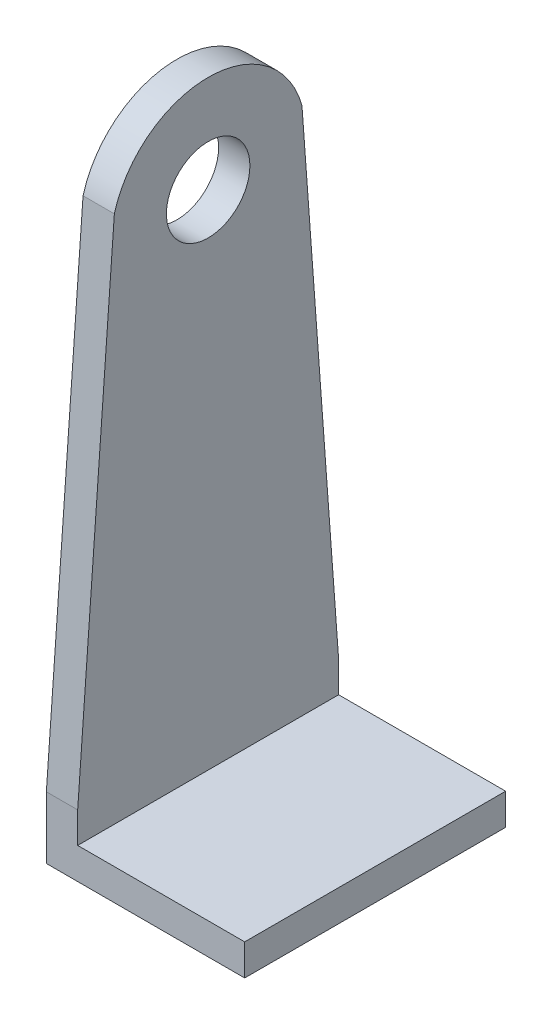
ISO-10303-21;
HEADER;
FILE_DESCRIPTION(('STEP AP214'),'2;1');
FILE_NAME('part.step','',(''),(''),'','','');
FILE_SCHEMA(('AUTOMOTIVE_DESIGN { 1 0 10303 214 1 1 1 1 }'));
ENDSEC;
DATA;
#1=APPLICATION_CONTEXT('core data for automotive mechanical design processes');
#2=APPLICATION_PROTOCOL_DEFINITION('international standard','automotive_design',2000,#1);
#3=PRODUCT_CONTEXT('',#1,'mechanical');
#4=PRODUCT('Part','Part','',(#3));
#5=PRODUCT_RELATED_PRODUCT_CATEGORY('part','',(#4));
#6=PRODUCT_DEFINITION_FORMATION('','',#4);
#7=PRODUCT_DEFINITION_CONTEXT('part definition',#1,'design');
#8=PRODUCT_DEFINITION('design','',#6,#7);
#9=PRODUCT_DEFINITION_SHAPE('','',#8);
#10=(LENGTH_UNIT() NAMED_UNIT(*) SI_UNIT(.MILLI.,.METRE.));
#11=(NAMED_UNIT(*) PLANE_ANGLE_UNIT() SI_UNIT($,.RADIAN.));
#12=(NAMED_UNIT(*) SI_UNIT($,.STERADIAN.) SOLID_ANGLE_UNIT());
#13=UNCERTAINTY_MEASURE_WITH_UNIT(LENGTH_MEASURE(1.E-05),#10,'distance_accuracy_value','');
#14=(GEOMETRIC_REPRESENTATION_CONTEXT(3) GLOBAL_UNCERTAINTY_ASSIGNED_CONTEXT((#13)) GLOBAL_UNIT_ASSIGNED_CONTEXT((#10,
#11,#12)) REPRESENTATION_CONTEXT('',''));
#15=CARTESIAN_POINT('',(0.,0.,0.));
#16=DIRECTION('',(0.,0.,1.));
#17=DIRECTION('',(1.,0.,0.));
#18=AXIS2_PLACEMENT_3D('',#15,#16,#17);
#19=CARTESIAN_POINT('',(15.5,-52.,0.));
#20=DIRECTION('',(-1.,0.,0.));
#21=DIRECTION('',(0.,0.,1.));
#22=AXIS2_PLACEMENT_3D('',#19,#20,#21);
#23=CYLINDRICAL_SURFACE('',#22,4.);
#24=CARTESIAN_POINT('',(16.5,-52.,0.));
#25=DIRECTION('',(-1.,0.,0.));
#26=DIRECTION('',(0.,0.,-1.));
#27=AXIS2_PLACEMENT_3D('',#24,#25,#26);
#28=CIRCLE('',#27,4.);
#29=CARTESIAN_POINT('',(16.5,-52.,-4.));
#30=VERTEX_POINT('',#29);
#31=EDGE_CURVE('E47',#30,#30,#28,.T.);
#32=ORIENTED_EDGE('',*,*,#31,.F.);
#33=EDGE_LOOP('',(#32));
#34=FACE_BOUND('',#33,.T.);
#35=CARTESIAN_POINT('',(13.5,-52.,0.));
#36=DIRECTION('',(1.,0.,0.));
#37=DIRECTION('',(0.,0.,-1.));
#38=AXIS2_PLACEMENT_3D('',#35,#36,#37);
#39=CIRCLE('',#38,4.);
#40=CARTESIAN_POINT('',(13.5,-52.,-4.));
#41=VERTEX_POINT('',#40);
#42=EDGE_CURVE('E166',#41,#41,#39,.T.);
#43=ORIENTED_EDGE('',*,*,#42,.F.);
#44=EDGE_LOOP('',(#43));
#45=FACE_BOUND('',#44,.T.);
#46=ADVANCED_FACE('F38',(#34,#45),#23,.F.);
#47=CARTESIAN_POINT('',(16.5,-100.7,-12.5));
#48=DIRECTION('',(1.,0.,0.));
#49=DIRECTION('',(0.,-1.,0.));
#50=AXIS2_PLACEMENT_3D('',#47,#48,#49);
#51=PLANE('',#50);
#52=DIRECTION('',(0.,-0.997297605701587,-0.0734675823876265));
#53=VECTOR('',#52,1.);
#54=CARTESIAN_POINT('',(16.5,-100.681108800183,-12.7564416540415));
#55=LINE('',#54,#53);
#56=CARTESIAN_POINT('',(16.5,-49.5,-8.986100377806));
#57=VERTEX_POINT('',#56);
#58=CARTESIAN_POINT('',(16.5,-97.2,-12.5));
#59=VERTEX_POINT('',#58);
#60=EDGE_CURVE('E117',#57,#59,#55,.T.);
#61=ORIENTED_EDGE('',*,*,#60,.F.);
#62=CARTESIAN_POINT('',(16.5,-52.0000000000001,0.));
#63=DIRECTION('',(1.,0.,0.));
#64=DIRECTION('',(0.,0.,-1.));
#65=AXIS2_PLACEMENT_3D('',#62,#63,#64);
#66=CIRCLE('',#65,9.32737905308911);
#67=CARTESIAN_POINT('',(16.5,-49.5,8.986100377806));
#68=VERTEX_POINT('',#67);
#69=EDGE_CURVE('E157',#57,#68,#66,.T.);
#70=ORIENTED_EDGE('',*,*,#69,.T.);
#71=DIRECTION('',(0.,0.997297605701587,-0.0734675823876265));
#72=VECTOR('',#71,1.);
#73=CARTESIAN_POINT('',(16.5,-98.8493826998868,12.6215045124945));
#74=LINE('',#73,#72);
#75=CARTESIAN_POINT('',(16.5,-97.2,12.5));
#76=VERTEX_POINT('',#75);
#77=EDGE_CURVE('E151',#76,#68,#74,.T.);
#78=ORIENTED_EDGE('',*,*,#77,.F.);
#79=DIRECTION('',(0.,1.,0.));
#80=VECTOR('',#79,1.);
#81=CARTESIAN_POINT('',(16.5,-100.7,12.5));
#82=LINE('',#81,#80);
#83=CARTESIAN_POINT('',(16.5,-100.149489742783,12.5));
#84=VERTEX_POINT('',#83);
#85=EDGE_CURVE('E122',#84,#76,#82,.T.);
#86=ORIENTED_EDGE('',*,*,#85,.F.);
#87=DIRECTION('',(0.,0.,1.));
#88=VECTOR('',#87,1.);
#89=CARTESIAN_POINT('',(16.5,-100.149489742783,12.5));
#90=LINE('',#89,#88);
#91=CARTESIAN_POINT('',(16.5,-100.149489742783,-12.5));
#92=VERTEX_POINT('',#91);
#93=EDGE_CURVE('E115',#92,#84,#90,.T.);
#94=ORIENTED_EDGE('',*,*,#93,.F.);
#95=DIRECTION('',(0.,1.,0.));
#96=VECTOR('',#95,1.);
#97=CARTESIAN_POINT('',(16.5,-100.7,-12.5));
#98=LINE('',#97,#96);
#99=EDGE_CURVE('E11',#92,#59,#98,.T.);
#100=ORIENTED_EDGE('',*,*,#99,.T.);
#101=EDGE_LOOP('',(#61,#70,#78,#86,#94,#100));
#102=FACE_BOUND('',#101,.T.);
#103=ORIENTED_EDGE('',*,*,#31,.T.);
#104=EDGE_LOOP('',(#103));
#105=FACE_BOUND('',#104,.T.);
#106=ADVANCED_FACE('F199',(#102,#105),#51,.T.);
#107=CARTESIAN_POINT('',(15.5,-70.85,12.5));
#108=DIRECTION('',(0.,0.,-1.));
#109=DIRECTION('',(0.,-1.,0.));
#110=AXIS2_PLACEMENT_3D('',#107,#108,#109);
#111=PLANE('',#110);
#112=DIRECTION('',(-1.,0.,0.));
#113=VECTOR('',#112,1.);
#114=CARTESIAN_POINT('',(32.5,-100.149489742783,12.5));
#115=LINE('',#114,#113);
#116=CARTESIAN_POINT('',(32.5,-100.149489742783,12.5));
#117=VERTEX_POINT('',#116);
#118=EDGE_CURVE('E111',#117,#84,#115,.T.);
#119=ORIENTED_EDGE('',*,*,#118,.T.);
#120=ORIENTED_EDGE('',*,*,#85,.T.);
#121=DIRECTION('',(-1.,0.,0.));
#122=VECTOR('',#121,1.);
#123=CARTESIAN_POINT('',(16.5,-97.2,12.5));
#124=LINE('',#123,#122);
#125=CARTESIAN_POINT('',(13.5,-97.2,12.5));
#126=VERTEX_POINT('',#125);
#127=EDGE_CURVE('E124',#76,#126,#124,.T.);
#128=ORIENTED_EDGE('',*,*,#127,.T.);
#129=DIRECTION('',(0.,-1.,0.));
#130=VECTOR('',#129,1.);
#131=CARTESIAN_POINT('',(13.5,0.,12.5));
#132=LINE('',#131,#130);
#133=CARTESIAN_POINT('',(13.5,-103.149489742783,12.5));
#134=VERTEX_POINT('',#133);
#135=EDGE_CURVE('E143',#126,#134,#132,.T.);
#136=ORIENTED_EDGE('',*,*,#135,.T.);
#137=DIRECTION('',(-1.,0.,0.));
#138=VECTOR('',#137,1.);
#139=CARTESIAN_POINT('',(75.6884089130718,-103.149489742783,12.5));
#140=LINE('',#139,#138);
#141=CARTESIAN_POINT('',(32.5,-103.149489742783,12.5));
#142=VERTEX_POINT('',#141);
#143=EDGE_CURVE('E101',#142,#134,#140,.T.);
#144=ORIENTED_EDGE('',*,*,#143,.F.);
#145=DIRECTION('',(0.,-1.,0.));
#146=VECTOR('',#145,1.);
#147=CARTESIAN_POINT('',(32.5,-103.149489742783,12.5));
#148=LINE('',#147,#146);
#149=EDGE_CURVE('E106',#117,#142,#148,.T.);
#150=ORIENTED_EDGE('',*,*,#149,.F.);
#151=EDGE_LOOP('',(#119,#120,#128,#136,#144,#150));
#152=FACE_BOUND('',#151,.T.);
#153=ADVANCED_FACE('F176',(#152),#111,.F.);
#154=CARTESIAN_POINT('',(15.93933982822,-101.76066017178,-12.5));
#155=DIRECTION('',(0.,0.,-1.));
#156=DIRECTION('',(1.,0.,0.));
#157=AXIS2_PLACEMENT_3D('',#154,#155,#156);
#158=PLANE('',#157);
#159=DIRECTION('',(-1.,0.,0.));
#160=VECTOR('',#159,1.);
#161=CARTESIAN_POINT('',(75.6884089130718,-103.149489742783,-12.5));
#162=LINE('',#161,#160);
#163=CARTESIAN_POINT('',(32.5,-103.149489742783,-12.5));
#164=VERTEX_POINT('',#163);
#165=CARTESIAN_POINT('',(13.5,-103.149489742783,-12.5));
#166=VERTEX_POINT('',#165);
#167=EDGE_CURVE('E88',#164,#166,#162,.T.);
#168=ORIENTED_EDGE('',*,*,#167,.T.);
#169=DIRECTION('',(0.,1.,0.));
#170=VECTOR('',#169,1.);
#171=CARTESIAN_POINT('',(13.5,0.,-12.5));
#172=LINE('',#171,#170);
#173=CARTESIAN_POINT('',(13.5,-97.2,-12.5));
#174=VERTEX_POINT('',#173);
#175=EDGE_CURVE('E141',#166,#174,#172,.T.);
#176=ORIENTED_EDGE('',*,*,#175,.T.);
#177=DIRECTION('',(-1.,0.,0.));
#178=VECTOR('',#177,1.);
#179=CARTESIAN_POINT('',(16.5,-97.2,-12.5));
#180=LINE('',#179,#178);
#181=EDGE_CURVE('E131',#59,#174,#180,.T.);
#182=ORIENTED_EDGE('',*,*,#181,.F.);
#183=ORIENTED_EDGE('',*,*,#99,.F.);
#184=DIRECTION('',(-1.,0.,0.));
#185=VECTOR('',#184,1.);
#186=CARTESIAN_POINT('',(32.5,-100.149489742783,-12.5));
#187=LINE('',#186,#185);
#188=CARTESIAN_POINT('',(32.5,-100.149489742783,-12.5));
#189=VERTEX_POINT('',#188);
#190=EDGE_CURVE('E67',#189,#92,#187,.T.);
#191=ORIENTED_EDGE('',*,*,#190,.F.);
#192=DIRECTION('',(0.,1.,0.));
#193=VECTOR('',#192,1.);
#194=CARTESIAN_POINT('',(32.5,-100.149489742783,-12.5));
#195=LINE('',#194,#193);
#196=EDGE_CURVE('E104',#164,#189,#195,.T.);
#197=ORIENTED_EDGE('',*,*,#196,.F.);
#198=EDGE_LOOP('',(#168,#176,#182,#183,#191,#197));
#199=FACE_BOUND('',#198,.T.);
#200=ADVANCED_FACE('F108',(#199),#158,.T.);
#201=CARTESIAN_POINT('',(75.6884089130718,-103.149489742783,-12.5));
#202=DIRECTION('',(0.,-1.,0.));
#203=DIRECTION('',(0.,0.,-1.));
#204=AXIS2_PLACEMENT_3D('',#201,#202,#203);
#205=PLANE('',#204);
#206=ORIENTED_EDGE('',*,*,#143,.T.);
#207=DIRECTION('',(0.,0.,-1.));
#208=VECTOR('',#207,1.);
#209=CARTESIAN_POINT('',(13.5,-103.149489742783,-12.5));
#210=LINE('',#209,#208);
#211=EDGE_CURVE('E95',#134,#166,#210,.T.);
#212=ORIENTED_EDGE('',*,*,#211,.T.);
#213=ORIENTED_EDGE('',*,*,#167,.F.);
#214=DIRECTION('',(0.,0.,-1.));
#215=VECTOR('',#214,1.);
#216=CARTESIAN_POINT('',(32.5,-103.149489742783,-12.5));
#217=LINE('',#216,#215);
#218=EDGE_CURVE('E92',#142,#164,#217,.T.);
#219=ORIENTED_EDGE('',*,*,#218,.F.);
#220=EDGE_LOOP('',(#206,#212,#213,#219));
#221=FACE_BOUND('',#220,.T.);
#222=ADVANCED_FACE('F91',(#221),#205,.T.);
#223=CARTESIAN_POINT('',(32.5,-100.149489742783,12.5));
#224=DIRECTION('',(0.,-1.,0.));
#225=DIRECTION('',(0.,0.,-1.));
#226=AXIS2_PLACEMENT_3D('',#223,#224,#225);
#227=PLANE('',#226);
#228=ORIENTED_EDGE('',*,*,#93,.T.);
#229=ORIENTED_EDGE('',*,*,#118,.F.);
#230=DIRECTION('',(0.,0.,1.));
#231=VECTOR('',#230,1.);
#232=CARTESIAN_POINT('',(32.5,-100.149489742783,12.5));
#233=LINE('',#232,#231);
#234=EDGE_CURVE('E56',#189,#117,#233,.T.);
#235=ORIENTED_EDGE('',*,*,#234,.F.);
#236=ORIENTED_EDGE('',*,*,#190,.T.);
#237=EDGE_LOOP('',(#228,#229,#235,#236));
#238=FACE_BOUND('',#237,.T.);
#239=ADVANCED_FACE('F219',(#238),#227,.F.);
#240=CARTESIAN_POINT('',(32.5,0.,0.));
#241=DIRECTION('',(-1.,0.,0.));
#242=DIRECTION('',(0.,0.,1.));
#243=AXIS2_PLACEMENT_3D('',#240,#241,#242);
#244=PLANE('',#243);
#245=ORIENTED_EDGE('',*,*,#149,.T.);
#246=ORIENTED_EDGE('',*,*,#218,.T.);
#247=ORIENTED_EDGE('',*,*,#196,.T.);
#248=ORIENTED_EDGE('',*,*,#234,.T.);
#249=EDGE_LOOP('',(#245,#246,#247,#248));
#250=FACE_BOUND('',#249,.T.);
#251=ADVANCED_FACE('F103',(#250),#244,.F.);
#252=CARTESIAN_POINT('',(22.,-49.5,-8.986100377806));
#253=DIRECTION('',(0.,-0.0734675823876265,0.997297605701587));
#254=DIRECTION('',(0.,-0.997297605701587,-0.0734675823876265));
#255=AXIS2_PLACEMENT_3D('',#252,#253,#254);
#256=PLANE('',#255);
#257=ORIENTED_EDGE('',*,*,#60,.T.);
#258=ORIENTED_EDGE('',*,*,#181,.T.);
#259=DIRECTION('',(0.,0.997297605701587,0.0734675823876265));
#260=VECTOR('',#259,1.);
#261=CARTESIAN_POINT('',(13.5,0.391227443813302,-5.31078035127329));
#262=LINE('',#261,#260);
#263=CARTESIAN_POINT('',(13.5,-49.5,-8.986100377806));
#264=VERTEX_POINT('',#263);
#265=EDGE_CURVE('E138',#174,#264,#262,.T.);
#266=ORIENTED_EDGE('',*,*,#265,.T.);
#267=DIRECTION('',(1.,0.,0.));
#268=VECTOR('',#267,1.);
#269=CARTESIAN_POINT('',(14.5,-49.5,-8.986100377806));
#270=LINE('',#269,#268);
#271=EDGE_CURVE('E41',#264,#57,#270,.T.);
#272=ORIENTED_EDGE('',*,*,#271,.T.);
#273=EDGE_LOOP('',(#257,#258,#266,#272));
#274=FACE_BOUND('',#273,.T.);
#275=ADVANCED_FACE('F135',(#274),#256,.F.);
#276=CARTESIAN_POINT('',(22.,-49.5,8.986100377806));
#277=DIRECTION('',(0.,-0.0734675823876265,-0.997297605701587));
#278=DIRECTION('',(0.,0.997297605701587,-0.0734675823876265));
#279=AXIS2_PLACEMENT_3D('',#276,#277,#278);
#280=PLANE('',#279);
#281=ORIENTED_EDGE('',*,*,#77,.T.);
#282=DIRECTION('',(1.,0.,0.));
#283=VECTOR('',#282,1.);
#284=CARTESIAN_POINT('',(14.5,-49.5,8.986100377806));
#285=LINE('',#284,#283);
#286=CARTESIAN_POINT('',(13.5,-49.5,8.986100377806));
#287=VERTEX_POINT('',#286);
#288=EDGE_CURVE('E100',#287,#68,#285,.T.);
#289=ORIENTED_EDGE('',*,*,#288,.F.);
#290=DIRECTION('',(0.,-0.997297605701587,0.0734675823876265));
#291=VECTOR('',#290,1.);
#292=CARTESIAN_POINT('',(13.5,0.391227443813302,5.31078035127329));
#293=LINE('',#292,#291);
#294=EDGE_CURVE('E164',#287,#126,#293,.T.);
#295=ORIENTED_EDGE('',*,*,#294,.T.);
#296=ORIENTED_EDGE('',*,*,#127,.F.);
#297=EDGE_LOOP('',(#281,#289,#295,#296));
#298=FACE_BOUND('',#297,.T.);
#299=ADVANCED_FACE('F183',(#298),#280,.F.);
#300=CARTESIAN_POINT('',(13.5,-52.0000000000001,0.));
#301=DIRECTION('',(1.,0.,0.));
#302=DIRECTION('',(0.,0.,-1.));
#303=AXIS2_PLACEMENT_3D('',#300,#301,#302);
#304=CYLINDRICAL_SURFACE('',#303,9.32737905308911);
#305=ORIENTED_EDGE('',*,*,#69,.F.);
#306=ORIENTED_EDGE('',*,*,#271,.F.);
#307=CARTESIAN_POINT('',(13.5,-52.0000000000001,0.));
#308=DIRECTION('',(1.,0.,0.));
#309=DIRECTION('',(0.,0.,-1.));
#310=AXIS2_PLACEMENT_3D('',#307,#308,#309);
#311=CIRCLE('',#310,9.32737905308911);
#312=EDGE_CURVE('E150',#264,#287,#311,.T.);
#313=ORIENTED_EDGE('',*,*,#312,.T.);
#314=ORIENTED_EDGE('',*,*,#288,.T.);
#315=EDGE_LOOP('',(#305,#306,#313,#314));
#316=FACE_BOUND('',#315,.T.);
#317=ADVANCED_FACE('F186',(#316),#304,.T.);
#318=CARTESIAN_POINT('',(13.5,0.,0.));
#319=DIRECTION('',(1.,0.,0.));
#320=DIRECTION('',(0.,0.,-1.));
#321=AXIS2_PLACEMENT_3D('',#318,#319,#320);
#322=PLANE('',#321);
#323=ORIENTED_EDGE('',*,*,#312,.F.);
#324=ORIENTED_EDGE('',*,*,#265,.F.);
#325=ORIENTED_EDGE('',*,*,#175,.F.);
#326=ORIENTED_EDGE('',*,*,#211,.F.);
#327=ORIENTED_EDGE('',*,*,#135,.F.);
#328=ORIENTED_EDGE('',*,*,#294,.F.);
#329=EDGE_LOOP('',(#323,#324,#325,#326,#327,#328));
#330=FACE_BOUND('',#329,.T.);
#331=ORIENTED_EDGE('',*,*,#42,.T.);
#332=EDGE_LOOP('',(#331));
#333=FACE_BOUND('',#332,.T.);
#334=ADVANCED_FACE('F146',(#330,#333),#322,.F.);
#335=CLOSED_SHELL('',(#46,#106,#153,#200,#222,#239,#251,#275,#299,#317,#334));
#336=MANIFOLD_SOLID_BREP('B2',#335);
#337=ADVANCED_BREP_SHAPE_REPRESENTATION('',(#18,#336),#14);
#338=SHAPE_DEFINITION_REPRESENTATION(#9,#337);
ENDSEC;
END-ISO-10303-21;
